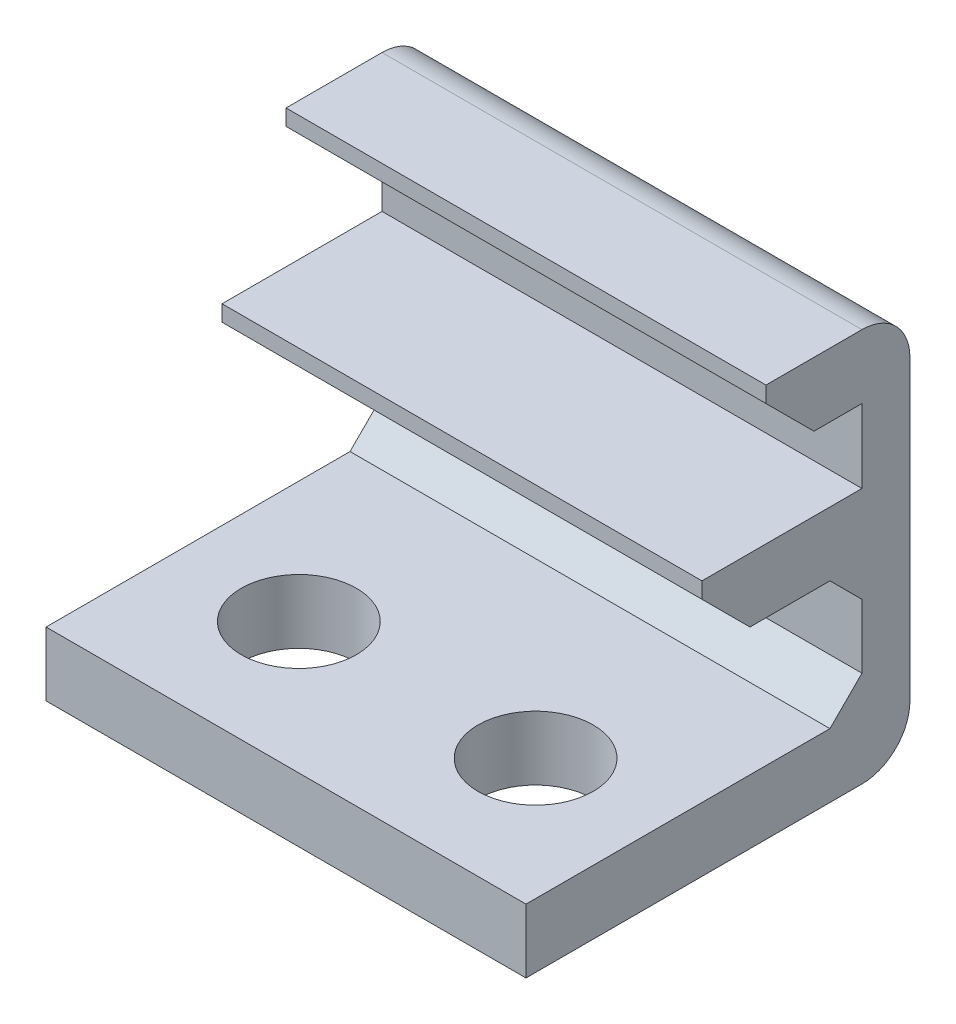
ISO-10303-21;
HEADER;
FILE_DESCRIPTION(('STEP AP214'),'2;1');
FILE_NAME('part.step','',(''),(''),'','','');
FILE_SCHEMA(('AUTOMOTIVE_DESIGN { 1 0 10303 214 1 1 1 1 }'));
ENDSEC;
DATA;
#1=APPLICATION_CONTEXT('core data for automotive mechanical design processes');
#2=APPLICATION_PROTOCOL_DEFINITION('international standard','automotive_design',2000,#1);
#3=PRODUCT_CONTEXT('',#1,'mechanical');
#4=PRODUCT('Part','Part','',(#3));
#5=PRODUCT_RELATED_PRODUCT_CATEGORY('part','',(#4));
#6=PRODUCT_DEFINITION_FORMATION('','',#4);
#7=PRODUCT_DEFINITION_CONTEXT('part definition',#1,'design');
#8=PRODUCT_DEFINITION('design','',#6,#7);
#9=PRODUCT_DEFINITION_SHAPE('','',#8);
#10=(LENGTH_UNIT() NAMED_UNIT(*) SI_UNIT(.MILLI.,.METRE.));
#11=(NAMED_UNIT(*) PLANE_ANGLE_UNIT() SI_UNIT($,.RADIAN.));
#12=(NAMED_UNIT(*) SI_UNIT($,.STERADIAN.) SOLID_ANGLE_UNIT());
#13=UNCERTAINTY_MEASURE_WITH_UNIT(LENGTH_MEASURE(1.E-05),#10,'distance_accuracy_value','');
#14=(GEOMETRIC_REPRESENTATION_CONTEXT(3) GLOBAL_UNCERTAINTY_ASSIGNED_CONTEXT((#13)) GLOBAL_UNIT_ASSIGNED_CONTEXT((#10,
#11,#12)) REPRESENTATION_CONTEXT('',''));
#15=CARTESIAN_POINT('',(0.,0.,0.));
#16=DIRECTION('',(0.,0.,1.));
#17=DIRECTION('',(1.,0.,0.));
#18=AXIS2_PLACEMENT_3D('',#15,#16,#17);
#19=CARTESIAN_POINT('',(7.5,0.,-0.25));
#20=DIRECTION('',(0.,0.,-1.));
#21=DIRECTION('',(0.,1.,0.));
#22=AXIS2_PLACEMENT_3D('',#19,#20,#21);
#23=PLANE('',#22);
#24=DIRECTION('',(0.,-1.,0.));
#25=VECTOR('',#24,1.);
#26=CARTESIAN_POINT('',(-7.5,0.,-0.25));
#27=LINE('',#26,#25);
#28=CARTESIAN_POINT('',(-7.5,1.85,-0.249999999999999));
#29=VERTEX_POINT('',#28);
#30=CARTESIAN_POINT('',(-7.5,1.35,-0.249999999999999));
#31=VERTEX_POINT('',#30);
#32=EDGE_CURVE('E216',#29,#31,#27,.T.);
#33=ORIENTED_EDGE('',*,*,#32,.T.);
#34=DIRECTION('',(1.,0.,0.));
#35=VECTOR('',#34,1.);
#36=CARTESIAN_POINT('',(7.5,1.35,-0.249999999999999));
#37=LINE('',#36,#35);
#38=CARTESIAN_POINT('',(7.5,1.35,-0.249999999999999));
#39=VERTEX_POINT('',#38);
#40=EDGE_CURVE('E11',#31,#39,#37,.T.);
#41=ORIENTED_EDGE('',*,*,#40,.T.);
#42=DIRECTION('',(0.,-1.,0.));
#43=VECTOR('',#42,1.);
#44=CARTESIAN_POINT('',(7.5,0.,-0.25));
#45=LINE('',#44,#43);
#46=CARTESIAN_POINT('',(7.5,1.85,-0.249999999999999));
#47=VERTEX_POINT('',#46);
#48=EDGE_CURVE('E247',#47,#39,#45,.T.);
#49=ORIENTED_EDGE('',*,*,#48,.F.);
#50=DIRECTION('',(-1.,0.,0.));
#51=VECTOR('',#50,1.);
#52=CARTESIAN_POINT('',(7.5,1.85,-0.249999999999999));
#53=LINE('',#52,#51);
#54=EDGE_CURVE('E215',#47,#29,#53,.T.);
#55=ORIENTED_EDGE('',*,*,#54,.T.);
#56=EDGE_LOOP('',(#33,#41,#49,#55));
#57=FACE_BOUND('',#56,.T.);
#58=ADVANCED_FACE('F40',(#57),#23,.F.);
#59=CARTESIAN_POINT('',(7.5,-0.149999999999999,0.));
#60=DIRECTION('',(0.,1.,0.));
#61=DIRECTION('',(0.,0.,1.));
#62=AXIS2_PLACEMENT_3D('',#59,#60,#61);
#63=PLANE('',#62);
#64=DIRECTION('',(0.,0.,-1.));
#65=VECTOR('',#64,1.);
#66=CARTESIAN_POINT('',(7.5,-0.149999999999999,0.));
#67=LINE('',#66,#65);
#68=CARTESIAN_POINT('',(7.5,-0.15,-1.75));
#69=VERTEX_POINT('',#68);
#70=CARTESIAN_POINT('',(7.5,-0.150000000000001,-4.25));
#71=VERTEX_POINT('',#70);
#72=EDGE_CURVE('E195',#69,#71,#67,.T.);
#73=ORIENTED_EDGE('',*,*,#72,.F.);
#74=DIRECTION('',(-1.,0.,0.));
#75=VECTOR('',#74,1.);
#76=CARTESIAN_POINT('',(7.5,-0.15,-1.75));
#77=LINE('',#76,#75);
#78=CARTESIAN_POINT('',(-7.5,-0.15,-1.75));
#79=VERTEX_POINT('',#78);
#80=EDGE_CURVE('E49',#69,#79,#77,.T.);
#81=ORIENTED_EDGE('',*,*,#80,.T.);
#82=DIRECTION('',(0.,0.,-1.));
#83=VECTOR('',#82,1.);
#84=CARTESIAN_POINT('',(-7.5,-0.149999999999999,0.));
#85=LINE('',#84,#83);
#86=CARTESIAN_POINT('',(-7.5,-0.150000000000001,-4.25));
#87=VERTEX_POINT('',#86);
#88=EDGE_CURVE('E218',#79,#87,#85,.T.);
#89=ORIENTED_EDGE('',*,*,#88,.T.);
#90=DIRECTION('',(1.,0.,0.));
#91=VECTOR('',#90,1.);
#92=CARTESIAN_POINT('',(7.5,-0.150000000000001,-4.25));
#93=LINE('',#92,#91);
#94=EDGE_CURVE('E263',#87,#71,#93,.T.);
#95=ORIENTED_EDGE('',*,*,#94,.T.);
#96=EDGE_LOOP('',(#73,#81,#89,#95));
#97=FACE_BOUND('',#96,.T.);
#98=ADVANCED_FACE('F307',(#97),#63,.F.);
#99=CARTESIAN_POINT('',(7.5,0.,-5.25));
#100=DIRECTION('',(0.,0.,-1.));
#101=DIRECTION('',(-1.,0.,0.));
#102=AXIS2_PLACEMENT_3D('',#99,#100,#101);
#103=PLANE('',#102);
#104=DIRECTION('',(0.,-1.,0.));
#105=VECTOR('',#104,1.);
#106=CARTESIAN_POINT('',(-7.5,0.,-5.25));
#107=LINE('',#106,#105);
#108=CARTESIAN_POINT('',(-7.5,-1.15000000000001,-5.25));
#109=VERTEX_POINT('',#108);
#110=CARTESIAN_POINT('',(-7.5,-3.15,-5.25));
#111=VERTEX_POINT('',#110);
#112=EDGE_CURVE('E221',#109,#111,#107,.T.);
#113=ORIENTED_EDGE('',*,*,#112,.T.);
#114=DIRECTION('',(1.,0.,0.));
#115=VECTOR('',#114,1.);
#116=CARTESIAN_POINT('',(7.5,-3.15,-5.25));
#117=LINE('',#116,#115);
#118=CARTESIAN_POINT('',(7.5,-3.15,-5.25));
#119=VERTEX_POINT('',#118);
#120=EDGE_CURVE('E261',#111,#119,#117,.T.);
#121=ORIENTED_EDGE('',*,*,#120,.T.);
#122=DIRECTION('',(0.,-1.,0.));
#123=VECTOR('',#122,1.);
#124=CARTESIAN_POINT('',(7.5,0.,-5.25));
#125=LINE('',#124,#123);
#126=CARTESIAN_POINT('',(7.5,-1.15000000000001,-5.25));
#127=VERTEX_POINT('',#126);
#128=EDGE_CURVE('E193',#127,#119,#125,.T.);
#129=ORIENTED_EDGE('',*,*,#128,.F.);
#130=DIRECTION('',(-1.,0.,0.));
#131=VECTOR('',#130,1.);
#132=CARTESIAN_POINT('',(-7.5,-1.15000000000001,-5.25));
#133=LINE('',#132,#131);
#134=EDGE_CURVE('E258',#127,#109,#133,.T.);
#135=ORIENTED_EDGE('',*,*,#134,.T.);
#136=EDGE_LOOP('',(#113,#121,#129,#135));
#137=FACE_BOUND('',#136,.T.);
#138=ADVANCED_FACE('F321',(#137),#103,.F.);
#139=CARTESIAN_POINT('',(7.5,-4.15,0.));
#140=DIRECTION('',(0.,1.,0.));
#141=DIRECTION('',(0.,0.,1.));
#142=AXIS2_PLACEMENT_3D('',#139,#140,#141);
#143=PLANE('',#142);
#144=CARTESIAN_POINT('',(-3.7,-4.15,1.15));
#145=DIRECTION('',(0.,1.,0.));
#146=DIRECTION('',(0.,0.,1.));
#147=AXIS2_PLACEMENT_3D('',#144,#145,#146);
#148=CIRCLE('',#147,1.8);
#149=CARTESIAN_POINT('',(-3.7,-4.15,2.95));
#150=VERTEX_POINT('',#149);
#151=EDGE_CURVE('E219',#150,#150,#148,.F.);
#152=ORIENTED_EDGE('',*,*,#151,.T.);
#153=EDGE_LOOP('',(#152));
#154=FACE_BOUND('',#153,.T.);
#155=CARTESIAN_POINT('',(3.7,-4.15,1.15));
#156=DIRECTION('',(0.,1.,0.));
#157=DIRECTION('',(0.,0.,1.));
#158=AXIS2_PLACEMENT_3D('',#155,#156,#157);
#159=CIRCLE('',#158,1.8);
#160=CARTESIAN_POINT('',(3.7,-4.15,2.95));
#161=VERTEX_POINT('',#160);
#162=EDGE_CURVE('E371',#161,#161,#159,.F.);
#163=ORIENTED_EDGE('',*,*,#162,.T.);
#164=EDGE_LOOP('',(#163));
#165=FACE_BOUND('',#164,.T.);
#166=DIRECTION('',(0.,0.,-1.));
#167=VECTOR('',#166,1.);
#168=CARTESIAN_POINT('',(7.5,-4.15,0.));
#169=LINE('',#168,#167);
#170=CARTESIAN_POINT('',(7.5,-4.15,5.25));
#171=VERTEX_POINT('',#170);
#172=CARTESIAN_POINT('',(7.5,-4.15,-4.24999999999999));
#173=VERTEX_POINT('',#172);
#174=EDGE_CURVE('E171',#171,#173,#169,.T.);
#175=ORIENTED_EDGE('',*,*,#174,.T.);
#176=DIRECTION('',(-1.,0.,0.));
#177=VECTOR('',#176,1.);
#178=CARTESIAN_POINT('',(7.5,-4.15,-4.24999999999999));
#179=LINE('',#178,#177);
#180=CARTESIAN_POINT('',(-7.5,-4.15,-4.24999999999999));
#181=VERTEX_POINT('',#180);
#182=EDGE_CURVE('E177',#173,#181,#179,.T.);
#183=ORIENTED_EDGE('',*,*,#182,.T.);
#184=DIRECTION('',(0.,0.,-1.));
#185=VECTOR('',#184,1.);
#186=CARTESIAN_POINT('',(-7.5,-4.15,0.));
#187=LINE('',#186,#185);
#188=CARTESIAN_POINT('',(-7.5,-4.15,5.25));
#189=VERTEX_POINT('',#188);
#190=EDGE_CURVE('E174',#189,#181,#187,.T.);
#191=ORIENTED_EDGE('',*,*,#190,.F.);
#192=DIRECTION('',(-1.,0.,0.));
#193=VECTOR('',#192,1.);
#194=CARTESIAN_POINT('',(7.5,-4.15,5.25));
#195=LINE('',#194,#193);
#196=EDGE_CURVE('E166',#171,#189,#195,.T.);
#197=ORIENTED_EDGE('',*,*,#196,.F.);
#198=EDGE_LOOP('',(#175,#183,#191,#197));
#199=FACE_BOUND('',#198,.T.);
#200=ADVANCED_FACE('F168',(#154,#165,#199),#143,.T.);
#201=CARTESIAN_POINT('',(7.5,0.,5.25));
#202=DIRECTION('',(0.,0.,-1.));
#203=DIRECTION('',(0.,1.,0.));
#204=AXIS2_PLACEMENT_3D('',#201,#202,#203);
#205=PLANE('',#204);
#206=DIRECTION('',(0.,-1.,0.));
#207=VECTOR('',#206,1.);
#208=CARTESIAN_POINT('',(-7.5,0.,5.25));
#209=LINE('',#208,#207);
#210=CARTESIAN_POINT('',(-7.5,-6.15,5.25));
#211=VERTEX_POINT('',#210);
#212=EDGE_CURVE('E225',#189,#211,#209,.T.);
#213=ORIENTED_EDGE('',*,*,#212,.T.);
#214=DIRECTION('',(-1.,0.,0.));
#215=VECTOR('',#214,1.);
#216=CARTESIAN_POINT('',(7.5,-6.15,5.25));
#217=LINE('',#216,#215);
#218=CARTESIAN_POINT('',(7.5,-6.15,5.25));
#219=VERTEX_POINT('',#218);
#220=EDGE_CURVE('E178',#219,#211,#217,.T.);
#221=ORIENTED_EDGE('',*,*,#220,.F.);
#222=DIRECTION('',(0.,-1.,0.));
#223=VECTOR('',#222,1.);
#224=CARTESIAN_POINT('',(7.5,0.,5.25));
#225=LINE('',#224,#223);
#226=EDGE_CURVE('E181',#171,#219,#225,.T.);
#227=ORIENTED_EDGE('',*,*,#226,.F.);
#228=ORIENTED_EDGE('',*,*,#196,.T.);
#229=EDGE_LOOP('',(#213,#221,#227,#228));
#230=FACE_BOUND('',#229,.T.);
#231=ADVANCED_FACE('F182',(#230),#205,.F.);
#232=CARTESIAN_POINT('',(7.5,-6.15,0.));
#233=DIRECTION('',(0.,1.,0.));
#234=DIRECTION('',(0.,0.,1.));
#235=AXIS2_PLACEMENT_3D('',#232,#233,#234);
#236=PLANE('',#235);
#237=CARTESIAN_POINT('',(-3.7,-6.15,1.15));
#238=DIRECTION('',(0.,1.,0.));
#239=DIRECTION('',(0.,0.,1.));
#240=AXIS2_PLACEMENT_3D('',#237,#238,#239);
#241=CIRCLE('',#240,1.8);
#242=CARTESIAN_POINT('',(-3.7,-6.15,2.95));
#243=VERTEX_POINT('',#242);
#244=EDGE_CURVE('E374',#243,#243,#241,.T.);
#245=ORIENTED_EDGE('',*,*,#244,.T.);
#246=EDGE_LOOP('',(#245));
#247=FACE_BOUND('',#246,.T.);
#248=CARTESIAN_POINT('',(3.7,-6.15,1.15));
#249=DIRECTION('',(0.,1.,0.));
#250=DIRECTION('',(0.,0.,-1.));
#251=AXIS2_PLACEMENT_3D('',#248,#249,#250);
#252=CIRCLE('',#251,1.8);
#253=CARTESIAN_POINT('',(3.7,-6.15,-0.649999999999999));
#254=VERTEX_POINT('',#253);
#255=EDGE_CURVE('E375',#254,#254,#252,.T.);
#256=ORIENTED_EDGE('',*,*,#255,.T.);
#257=EDGE_LOOP('',(#256));
#258=FACE_BOUND('',#257,.T.);
#259=DIRECTION('',(0.,0.,-1.));
#260=VECTOR('',#259,1.);
#261=CARTESIAN_POINT('',(-7.5,-6.15,0.));
#262=LINE('',#261,#260);
#263=CARTESIAN_POINT('',(-7.5,-6.15,-5.25));
#264=VERTEX_POINT('',#263);
#265=EDGE_CURVE('E227',#211,#264,#262,.T.);
#266=ORIENTED_EDGE('',*,*,#265,.T.);
#267=DIRECTION('',(-1.,0.,0.));
#268=VECTOR('',#267,1.);
#269=CARTESIAN_POINT('',(7.5,-6.15,-5.25));
#270=LINE('',#269,#268);
#271=CARTESIAN_POINT('',(7.5,-6.15,-5.25));
#272=VERTEX_POINT('',#271);
#273=EDGE_CURVE('E283',#264,#272,#270,.F.);
#274=ORIENTED_EDGE('',*,*,#273,.T.);
#275=DIRECTION('',(0.,0.,-1.));
#276=VECTOR('',#275,1.);
#277=CARTESIAN_POINT('',(7.5,-6.15,0.));
#278=LINE('',#277,#276);
#279=EDGE_CURVE('E186',#219,#272,#278,.T.);
#280=ORIENTED_EDGE('',*,*,#279,.F.);
#281=ORIENTED_EDGE('',*,*,#220,.T.);
#282=EDGE_LOOP('',(#266,#274,#280,#281));
#283=FACE_BOUND('',#282,.T.);
#284=ADVANCED_FACE('F327',(#247,#258,#283),#236,.F.);
#285=CARTESIAN_POINT('',(7.5,0.,-6.75));
#286=DIRECTION('',(0.,0.,-1.));
#287=DIRECTION('',(0.,1.,0.));
#288=AXIS2_PLACEMENT_3D('',#285,#286,#287);
#289=PLANE('',#288);
#290=DIRECTION('',(0.,-1.,0.));
#291=VECTOR('',#290,1.);
#292=CARTESIAN_POINT('',(7.5,0.,-6.75));
#293=LINE('',#292,#291);
#294=CARTESIAN_POINT('',(7.5,4.65,-6.75));
#295=VERTEX_POINT('',#294);
#296=CARTESIAN_POINT('',(7.5,-4.65,-6.75));
#297=VERTEX_POINT('',#296);
#298=EDGE_CURVE('E200',#295,#297,#293,.T.);
#299=ORIENTED_EDGE('',*,*,#298,.T.);
#300=DIRECTION('',(-1.,0.,0.));
#301=VECTOR('',#300,1.);
#302=CARTESIAN_POINT('',(-7.5,-4.65,-6.75));
#303=LINE('',#302,#301);
#304=CARTESIAN_POINT('',(-7.5,-4.65,-6.75));
#305=VERTEX_POINT('',#304);
#306=EDGE_CURVE('E276',#297,#305,#303,.T.);
#307=ORIENTED_EDGE('',*,*,#306,.T.);
#308=DIRECTION('',(0.,-1.,0.));
#309=VECTOR('',#308,1.);
#310=CARTESIAN_POINT('',(-7.5,0.,-6.75));
#311=LINE('',#310,#309);
#312=CARTESIAN_POINT('',(-7.5,4.65,-6.75));
#313=VERTEX_POINT('',#312);
#314=EDGE_CURVE('E230',#313,#305,#311,.T.);
#315=ORIENTED_EDGE('',*,*,#314,.F.);
#316=DIRECTION('',(-1.,0.,0.));
#317=VECTOR('',#316,1.);
#318=CARTESIAN_POINT('',(7.5,4.65,-6.75));
#319=LINE('',#318,#317);
#320=EDGE_CURVE('E274',#313,#295,#319,.F.);
#321=ORIENTED_EDGE('',*,*,#320,.T.);
#322=EDGE_LOOP('',(#299,#307,#315,#321));
#323=FACE_BOUND('',#322,.T.);
#324=ADVANCED_FACE('F336',(#323),#289,.T.);
#325=CARTESIAN_POINT('',(7.5,6.15,0.));
#326=DIRECTION('',(0.,1.,0.));
#327=DIRECTION('',(0.,0.,1.));
#328=AXIS2_PLACEMENT_3D('',#325,#326,#327);
#329=PLANE('',#328);
#330=DIRECTION('',(0.,0.,-1.));
#331=VECTOR('',#330,1.);
#332=CARTESIAN_POINT('',(7.5,6.15,0.));
#333=LINE('',#332,#331);
#334=CARTESIAN_POINT('',(7.5,6.15,-2.25000000000003));
#335=VERTEX_POINT('',#334);
#336=CARTESIAN_POINT('',(7.5,6.15,-5.25));
#337=VERTEX_POINT('',#336);
#338=EDGE_CURVE('E203',#335,#337,#333,.T.);
#339=ORIENTED_EDGE('',*,*,#338,.T.);
#340=DIRECTION('',(-1.,0.,0.));
#341=VECTOR('',#340,1.);
#342=CARTESIAN_POINT('',(7.5,6.15,-5.25));
#343=LINE('',#342,#341);
#344=CARTESIAN_POINT('',(-7.5,6.15,-5.25));
#345=VERTEX_POINT('',#344);
#346=EDGE_CURVE('E289',#337,#345,#343,.T.);
#347=ORIENTED_EDGE('',*,*,#346,.T.);
#348=DIRECTION('',(0.,0.,-1.));
#349=VECTOR('',#348,1.);
#350=CARTESIAN_POINT('',(-7.5,6.15,0.));
#351=LINE('',#350,#349);
#352=CARTESIAN_POINT('',(-7.5,6.15,-2.25000000000003));
#353=VERTEX_POINT('',#352);
#354=EDGE_CURVE('E233',#353,#345,#351,.T.);
#355=ORIENTED_EDGE('',*,*,#354,.F.);
#356=DIRECTION('',(-1.,0.,0.));
#357=VECTOR('',#356,1.);
#358=CARTESIAN_POINT('',(7.5,6.15,-2.25000000000003));
#359=LINE('',#358,#357);
#360=EDGE_CURVE('E254',#335,#353,#359,.T.);
#361=ORIENTED_EDGE('',*,*,#360,.F.);
#362=EDGE_LOOP('',(#339,#347,#355,#361));
#363=FACE_BOUND('',#362,.T.);
#364=ADVANCED_FACE('F345',(#363),#329,.T.);
#365=CARTESIAN_POINT('',(7.5,0.,-2.25000000000002));
#366=DIRECTION('',(0.,0.,-1.));
#367=DIRECTION('',(0.,1.,0.));
#368=AXIS2_PLACEMENT_3D('',#365,#366,#367);
#369=PLANE('',#368);
#370=DIRECTION('',(0.,-1.,0.));
#371=VECTOR('',#370,1.);
#372=CARTESIAN_POINT('',(-7.5,0.,-2.25000000000002));
#373=LINE('',#372,#371);
#374=CARTESIAN_POINT('',(-7.5,5.65,-2.25000000000003));
#375=VERTEX_POINT('',#374);
#376=EDGE_CURVE('E236',#353,#375,#373,.T.);
#377=ORIENTED_EDGE('',*,*,#376,.T.);
#378=DIRECTION('',(1.,0.,0.));
#379=VECTOR('',#378,1.);
#380=CARTESIAN_POINT('',(7.5,5.65,-2.25000000000003));
#381=LINE('',#380,#379);
#382=CARTESIAN_POINT('',(7.5,5.65,-2.25000000000003));
#383=VERTEX_POINT('',#382);
#384=EDGE_CURVE('E299',#375,#383,#381,.T.);
#385=ORIENTED_EDGE('',*,*,#384,.T.);
#386=DIRECTION('',(0.,-1.,0.));
#387=VECTOR('',#386,1.);
#388=CARTESIAN_POINT('',(7.5,0.,-2.25000000000002));
#389=LINE('',#388,#387);
#390=EDGE_CURVE('E206',#335,#383,#389,.T.);
#391=ORIENTED_EDGE('',*,*,#390,.F.);
#392=ORIENTED_EDGE('',*,*,#360,.T.);
#393=EDGE_LOOP('',(#377,#385,#391,#392));
#394=FACE_BOUND('',#393,.T.);
#395=ADVANCED_FACE('F457',(#394),#369,.F.);
#396=CARTESIAN_POINT('',(7.5,4.15,0.));
#397=DIRECTION('',(0.,1.,0.));
#398=DIRECTION('',(0.,0.,1.));
#399=AXIS2_PLACEMENT_3D('',#396,#397,#398);
#400=PLANE('',#399);
#401=DIRECTION('',(0.,0.,-1.));
#402=VECTOR('',#401,1.);
#403=CARTESIAN_POINT('',(7.5,4.15,0.));
#404=LINE('',#403,#402);
#405=CARTESIAN_POINT('',(7.5,4.15,-3.75000000000002));
#406=VERTEX_POINT('',#405);
#407=CARTESIAN_POINT('',(7.5,4.15,-5.25));
#408=VERTEX_POINT('',#407);
#409=EDGE_CURVE('E208',#406,#408,#404,.T.);
#410=ORIENTED_EDGE('',*,*,#409,.F.);
#411=DIRECTION('',(-1.,0.,0.));
#412=VECTOR('',#411,1.);
#413=CARTESIAN_POINT('',(7.5,4.15,-3.75000000000002));
#414=LINE('',#413,#412);
#415=CARTESIAN_POINT('',(-7.5,4.15,-3.75000000000002));
#416=VERTEX_POINT('',#415);
#417=EDGE_CURVE('E292',#406,#416,#414,.T.);
#418=ORIENTED_EDGE('',*,*,#417,.T.);
#419=DIRECTION('',(0.,0.,-1.));
#420=VECTOR('',#419,1.);
#421=CARTESIAN_POINT('',(-7.5,4.15,0.));
#422=LINE('',#421,#420);
#423=CARTESIAN_POINT('',(-7.5,4.15,-5.25));
#424=VERTEX_POINT('',#423);
#425=EDGE_CURVE('E239',#416,#424,#422,.T.);
#426=ORIENTED_EDGE('',*,*,#425,.T.);
#427=DIRECTION('',(-1.,0.,0.));
#428=VECTOR('',#427,1.);
#429=CARTESIAN_POINT('',(7.5,4.15,-5.25));
#430=LINE('',#429,#428);
#431=EDGE_CURVE('E251',#408,#424,#430,.T.);
#432=ORIENTED_EDGE('',*,*,#431,.F.);
#433=EDGE_LOOP('',(#410,#418,#426,#432));
#434=FACE_BOUND('',#433,.T.);
#435=ADVANCED_FACE('F356',(#434),#400,.F.);
#436=CARTESIAN_POINT('',(7.5,0.,-5.25));
#437=DIRECTION('',(0.,0.,-1.));
#438=DIRECTION('',(-1.,0.,0.));
#439=AXIS2_PLACEMENT_3D('',#436,#437,#438);
#440=PLANE('',#439);
#441=DIRECTION('',(0.,-1.,0.));
#442=VECTOR('',#441,1.);
#443=CARTESIAN_POINT('',(-7.5,0.,-5.25));
#444=LINE('',#443,#442);
#445=CARTESIAN_POINT('',(-7.5,1.85,-5.25));
#446=VERTEX_POINT('',#445);
#447=EDGE_CURVE('E241',#424,#446,#444,.T.);
#448=ORIENTED_EDGE('',*,*,#447,.T.);
#449=DIRECTION('',(-1.,0.,0.));
#450=VECTOR('',#449,1.);
#451=CARTESIAN_POINT('',(7.5,1.85,-5.25));
#452=LINE('',#451,#450);
#453=CARTESIAN_POINT('',(7.5,1.85,-5.25));
#454=VERTEX_POINT('',#453);
#455=EDGE_CURVE('E249',#454,#446,#452,.T.);
#456=ORIENTED_EDGE('',*,*,#455,.F.);
#457=DIRECTION('',(0.,-1.,0.));
#458=VECTOR('',#457,1.);
#459=CARTESIAN_POINT('',(7.5,0.,-5.25));
#460=LINE('',#459,#458);
#461=EDGE_CURVE('E210',#408,#454,#460,.T.);
#462=ORIENTED_EDGE('',*,*,#461,.F.);
#463=ORIENTED_EDGE('',*,*,#431,.T.);
#464=EDGE_LOOP('',(#448,#456,#462,#463));
#465=FACE_BOUND('',#464,.T.);
#466=ADVANCED_FACE('F362',(#465),#440,.F.);
#467=CARTESIAN_POINT('',(7.5,1.85,0.));
#468=DIRECTION('',(0.,1.,0.));
#469=DIRECTION('',(0.,0.,1.));
#470=AXIS2_PLACEMENT_3D('',#467,#468,#469);
#471=PLANE('',#470);
#472=DIRECTION('',(0.,0.,-1.));
#473=VECTOR('',#472,1.);
#474=CARTESIAN_POINT('',(-7.5,1.85,0.));
#475=LINE('',#474,#473);
#476=EDGE_CURVE('E244',#29,#446,#475,.T.);
#477=ORIENTED_EDGE('',*,*,#476,.F.);
#478=ORIENTED_EDGE('',*,*,#54,.F.);
#479=DIRECTION('',(0.,0.,-1.));
#480=VECTOR('',#479,1.);
#481=CARTESIAN_POINT('',(7.5,1.85,0.));
#482=LINE('',#481,#480);
#483=EDGE_CURVE('E212',#47,#454,#482,.T.);
#484=ORIENTED_EDGE('',*,*,#483,.T.);
#485=ORIENTED_EDGE('',*,*,#455,.T.);
#486=EDGE_LOOP('',(#477,#478,#484,#485));
#487=FACE_BOUND('',#486,.T.);
#488=ADVANCED_FACE('F366',(#487),#471,.T.);
#489=CARTESIAN_POINT('',(7.5,0.,0.));
#490=DIRECTION('',(1.,0.,0.));
#491=DIRECTION('',(0.,0.,-1.));
#492=AXIS2_PLACEMENT_3D('',#489,#490,#491);
#493=PLANE('',#492);
#494=ORIENTED_EDGE('',*,*,#390,.T.);
#495=DIRECTION('',(0.,0.707106781186549,0.707106781186546));
#496=VECTOR('',#495,1.);
#497=CARTESIAN_POINT('',(7.5,3.95,-3.95000000000002));
#498=LINE('',#497,#496);
#499=EDGE_CURVE('E302',#383,#406,#498,.F.);
#500=ORIENTED_EDGE('',*,*,#499,.T.);
#501=ORIENTED_EDGE('',*,*,#409,.T.);
#502=ORIENTED_EDGE('',*,*,#461,.T.);
#503=ORIENTED_EDGE('',*,*,#483,.F.);
#504=ORIENTED_EDGE('',*,*,#48,.T.);
#505=DIRECTION('',(0.,0.707106781186548,0.707106781186547));
#506=VECTOR('',#505,1.);
#507=CARTESIAN_POINT('',(7.5,0.800000000000001,-0.800000000000002));
#508=LINE('',#507,#506);
#509=EDGE_CURVE('E56',#39,#69,#508,.F.);
#510=ORIENTED_EDGE('',*,*,#509,.T.);
#511=ORIENTED_EDGE('',*,*,#72,.T.);
#512=DIRECTION('',(0.,0.707106781186552,0.707106781186543));
#513=VECTOR('',#512,1.);
#514=CARTESIAN_POINT('',(7.5,-1.15000000000001,-5.25));
#515=LINE('',#514,#513);
#516=EDGE_CURVE('E272',#71,#127,#515,.F.);
#517=ORIENTED_EDGE('',*,*,#516,.T.);
#518=ORIENTED_EDGE('',*,*,#128,.T.);
#519=DIRECTION('',(0.,-0.707106781186544,0.707106781186551));
#520=VECTOR('',#519,1.);
#521=CARTESIAN_POINT('',(7.5,-4.15,-4.24999999999999));
#522=LINE('',#521,#520);
#523=EDGE_CURVE('E192',#119,#173,#522,.T.);
#524=ORIENTED_EDGE('',*,*,#523,.T.);
#525=ORIENTED_EDGE('',*,*,#174,.F.);
#526=ORIENTED_EDGE('',*,*,#226,.T.);
#527=ORIENTED_EDGE('',*,*,#279,.T.);
#528=CARTESIAN_POINT('',(7.5,-4.65,-5.25));
#529=DIRECTION('',(1.,0.,0.));
#530=DIRECTION('',(0.,0.,-1.));
#531=AXIS2_PLACEMENT_3D('',#528,#529,#530);
#532=CIRCLE('',#531,1.5);
#533=EDGE_CURVE('E287',#272,#297,#532,.T.);
#534=ORIENTED_EDGE('',*,*,#533,.T.);
#535=ORIENTED_EDGE('',*,*,#298,.F.);
#536=CARTESIAN_POINT('',(7.5,4.65,-5.25));
#537=DIRECTION('',(1.,0.,0.));
#538=DIRECTION('',(0.,0.,-1.));
#539=AXIS2_PLACEMENT_3D('',#536,#537,#538);
#540=CIRCLE('',#539,1.5);
#541=EDGE_CURVE('E285',#295,#337,#540,.T.);
#542=ORIENTED_EDGE('',*,*,#541,.T.);
#543=ORIENTED_EDGE('',*,*,#338,.F.);
#544=EDGE_LOOP('',(#494,#500,#501,#502,#503,#504,#510,#511,#517,#518,#524,#525,#526,#527,#534,
#535,#542,#543));
#545=FACE_BOUND('',#544,.T.);
#546=ADVANCED_FACE('F189',(#545),#493,.T.);
#547=CARTESIAN_POINT('',(-7.5,0.,0.));
#548=DIRECTION('',(1.,0.,0.));
#549=DIRECTION('',(0.,0.,-1.));
#550=AXIS2_PLACEMENT_3D('',#547,#548,#549);
#551=PLANE('',#550);
#552=ORIENTED_EDGE('',*,*,#425,.F.);
#553=DIRECTION('',(0.,-0.707106781186549,-0.707106781186546));
#554=VECTOR('',#553,1.);
#555=CARTESIAN_POINT('',(-7.5,4.15,-3.75000000000002));
#556=LINE('',#555,#554);
#557=EDGE_CURVE('E297',#416,#375,#556,.F.);
#558=ORIENTED_EDGE('',*,*,#557,.T.);
#559=ORIENTED_EDGE('',*,*,#376,.F.);
#560=ORIENTED_EDGE('',*,*,#354,.T.);
#561=CARTESIAN_POINT('',(-7.5,4.65,-5.25));
#562=DIRECTION('',(1.,0.,0.));
#563=DIRECTION('',(0.,0.,-1.));
#564=AXIS2_PLACEMENT_3D('',#561,#562,#563);
#565=CIRCLE('',#564,1.5);
#566=EDGE_CURVE('E279',#345,#313,#565,.F.);
#567=ORIENTED_EDGE('',*,*,#566,.T.);
#568=ORIENTED_EDGE('',*,*,#314,.T.);
#569=CARTESIAN_POINT('',(-7.5,-4.65,-5.25));
#570=DIRECTION('',(1.,0.,0.));
#571=DIRECTION('',(0.,0.,-1.));
#572=AXIS2_PLACEMENT_3D('',#569,#570,#571);
#573=CIRCLE('',#572,1.5);
#574=EDGE_CURVE('E281',#305,#264,#573,.F.);
#575=ORIENTED_EDGE('',*,*,#574,.T.);
#576=ORIENTED_EDGE('',*,*,#265,.F.);
#577=ORIENTED_EDGE('',*,*,#212,.F.);
#578=ORIENTED_EDGE('',*,*,#190,.T.);
#579=DIRECTION('',(0.,0.707106781186544,-0.707106781186551));
#580=VECTOR('',#579,1.);
#581=CARTESIAN_POINT('',(-7.5,-4.20000000000002,-4.19999999999997));
#582=LINE('',#581,#580);
#583=EDGE_CURVE('E266',#181,#111,#582,.T.);
#584=ORIENTED_EDGE('',*,*,#583,.T.);
#585=ORIENTED_EDGE('',*,*,#112,.F.);
#586=DIRECTION('',(0.,-0.707106781186552,-0.707106781186543));
#587=VECTOR('',#586,1.);
#588=CARTESIAN_POINT('',(-7.5,2.05,-2.05000000000003));
#589=LINE('',#588,#587);
#590=EDGE_CURVE('E269',#109,#87,#589,.F.);
#591=ORIENTED_EDGE('',*,*,#590,.T.);
#592=ORIENTED_EDGE('',*,*,#88,.F.);
#593=DIRECTION('',(0.,-0.707106781186548,-0.707106781186547));
#594=VECTOR('',#593,1.);
#595=CARTESIAN_POINT('',(-7.5,-0.15,-1.75));
#596=LINE('',#595,#594);
#597=EDGE_CURVE('E295',#79,#31,#596,.F.);
#598=ORIENTED_EDGE('',*,*,#597,.T.);
#599=ORIENTED_EDGE('',*,*,#32,.F.);
#600=ORIENTED_EDGE('',*,*,#476,.T.);
#601=ORIENTED_EDGE('',*,*,#447,.F.);
#602=EDGE_LOOP('',(#552,#558,#559,#560,#567,#568,#575,#576,#577,#578,#584,#585,#591,#592,#598,
#599,#600,#601));
#603=FACE_BOUND('',#602,.T.);
#604=ADVANCED_FACE('F311',(#603),#551,.F.);
#605=CARTESIAN_POINT('',(7.5,-4.15,-4.24999999999999));
#606=DIRECTION('',(0.,-0.707106781186551,-0.707106781186544));
#607=DIRECTION('',(-1.,0.,0.));
#608=AXIS2_PLACEMENT_3D('',#605,#606,#607);
#609=PLANE('',#608);
#610=ORIENTED_EDGE('',*,*,#523,.F.);
#611=ORIENTED_EDGE('',*,*,#120,.F.);
#612=ORIENTED_EDGE('',*,*,#583,.F.);
#613=ORIENTED_EDGE('',*,*,#182,.F.);
#614=EDGE_LOOP('',(#610,#611,#612,#613));
#615=FACE_BOUND('',#614,.T.);
#616=ADVANCED_FACE('F324',(#615),#609,.F.);
#617=CARTESIAN_POINT('',(7.5,-1.15000000000001,-5.25));
#618=DIRECTION('',(0.,-0.707106781186542,0.707106781186552));
#619=DIRECTION('',(1.,0.,0.));
#620=AXIS2_PLACEMENT_3D('',#617,#618,#619);
#621=PLANE('',#620);
#622=ORIENTED_EDGE('',*,*,#516,.F.);
#623=ORIENTED_EDGE('',*,*,#94,.F.);
#624=ORIENTED_EDGE('',*,*,#590,.F.);
#625=ORIENTED_EDGE('',*,*,#134,.F.);
#626=EDGE_LOOP('',(#622,#623,#624,#625));
#627=FACE_BOUND('',#626,.T.);
#628=ADVANCED_FACE('F318',(#627),#621,.T.);
#629=CARTESIAN_POINT('',(3.7,-1.15,1.15));
#630=DIRECTION('',(0.,-1.,0.));
#631=DIRECTION('',(0.,0.,-1.));
#632=AXIS2_PLACEMENT_3D('',#629,#630,#631);
#633=CYLINDRICAL_SURFACE('',#632,1.8);
#634=ORIENTED_EDGE('',*,*,#162,.F.);
#635=EDGE_LOOP('',(#634));
#636=FACE_BOUND('',#635,.T.);
#637=ORIENTED_EDGE('',*,*,#255,.F.);
#638=EDGE_LOOP('',(#637));
#639=FACE_BOUND('',#638,.T.);
#640=ADVANCED_FACE('F385',(#636,#639),#633,.F.);
#641=CARTESIAN_POINT('',(-3.7,-1.15,1.15));
#642=DIRECTION('',(0.,-1.,0.));
#643=DIRECTION('',(0.,0.,-1.));
#644=AXIS2_PLACEMENT_3D('',#641,#642,#643);
#645=CYLINDRICAL_SURFACE('',#644,1.8);
#646=ORIENTED_EDGE('',*,*,#151,.F.);
#647=EDGE_LOOP('',(#646));
#648=FACE_BOUND('',#647,.T.);
#649=ORIENTED_EDGE('',*,*,#244,.F.);
#650=EDGE_LOOP('',(#649));
#651=FACE_BOUND('',#650,.T.);
#652=ADVANCED_FACE('F383',(#648,#651),#645,.F.);
#653=CARTESIAN_POINT('',(7.5,-4.65,-5.25));
#654=DIRECTION('',(1.,0.,0.));
#655=DIRECTION('',(0.,0.,-1.));
#656=AXIS2_PLACEMENT_3D('',#653,#654,#655);
#657=CYLINDRICAL_SURFACE('',#656,1.5);
#658=ORIENTED_EDGE('',*,*,#533,.F.);
#659=ORIENTED_EDGE('',*,*,#273,.F.);
#660=ORIENTED_EDGE('',*,*,#574,.F.);
#661=ORIENTED_EDGE('',*,*,#306,.F.);
#662=EDGE_LOOP('',(#658,#659,#660,#661));
#663=FACE_BOUND('',#662,.T.);
#664=ADVANCED_FACE('F333',(#663),#657,.T.);
#665=CARTESIAN_POINT('',(7.5,4.65,-5.25));
#666=DIRECTION('',(-1.,0.,0.));
#667=DIRECTION('',(0.,0.,1.));
#668=AXIS2_PLACEMENT_3D('',#665,#666,#667);
#669=CYLINDRICAL_SURFACE('',#668,1.5);
#670=ORIENTED_EDGE('',*,*,#541,.F.);
#671=ORIENTED_EDGE('',*,*,#320,.F.);
#672=ORIENTED_EDGE('',*,*,#566,.F.);
#673=ORIENTED_EDGE('',*,*,#346,.F.);
#674=EDGE_LOOP('',(#670,#671,#672,#673));
#675=FACE_BOUND('',#674,.T.);
#676=ADVANCED_FACE('F343',(#675),#669,.T.);
#677=CARTESIAN_POINT('',(7.5,4.15,-3.75000000000002));
#678=DIRECTION('',(0.,0.707106781186546,-0.707106781186549));
#679=DIRECTION('',(-1.,0.,0.));
#680=AXIS2_PLACEMENT_3D('',#677,#678,#679);
#681=PLANE('',#680);
#682=ORIENTED_EDGE('',*,*,#499,.F.);
#683=ORIENTED_EDGE('',*,*,#384,.F.);
#684=ORIENTED_EDGE('',*,*,#557,.F.);
#685=ORIENTED_EDGE('',*,*,#417,.F.);
#686=EDGE_LOOP('',(#682,#683,#684,#685));
#687=FACE_BOUND('',#686,.T.);
#688=ADVANCED_FACE('F354',(#687),#681,.F.);
#689=CARTESIAN_POINT('',(7.5,-0.15,-1.75));
#690=DIRECTION('',(0.,0.707106781186547,-0.707106781186548));
#691=DIRECTION('',(-1.,0.,0.));
#692=AXIS2_PLACEMENT_3D('',#689,#690,#691);
#693=PLANE('',#692);
#694=ORIENTED_EDGE('',*,*,#509,.F.);
#695=ORIENTED_EDGE('',*,*,#40,.F.);
#696=ORIENTED_EDGE('',*,*,#597,.F.);
#697=ORIENTED_EDGE('',*,*,#80,.F.);
#698=EDGE_LOOP('',(#694,#695,#696,#697));
#699=FACE_BOUND('',#698,.T.);
#700=ADVANCED_FACE('F43',(#699),#693,.F.);
#701=CLOSED_SHELL('',(#58,#98,#138,#200,#231,#284,#324,#364,#395,#435,#466,#488,#546,#604,#616,
#628,#640,#652,#664,#676,#688,#700));
#702=MANIFOLD_SOLID_BREP('B2',#701);
#703=ADVANCED_BREP_SHAPE_REPRESENTATION('',(#18,#702),#14);
#704=SHAPE_DEFINITION_REPRESENTATION(#9,#703);
ENDSEC;
END-ISO-10303-21;
